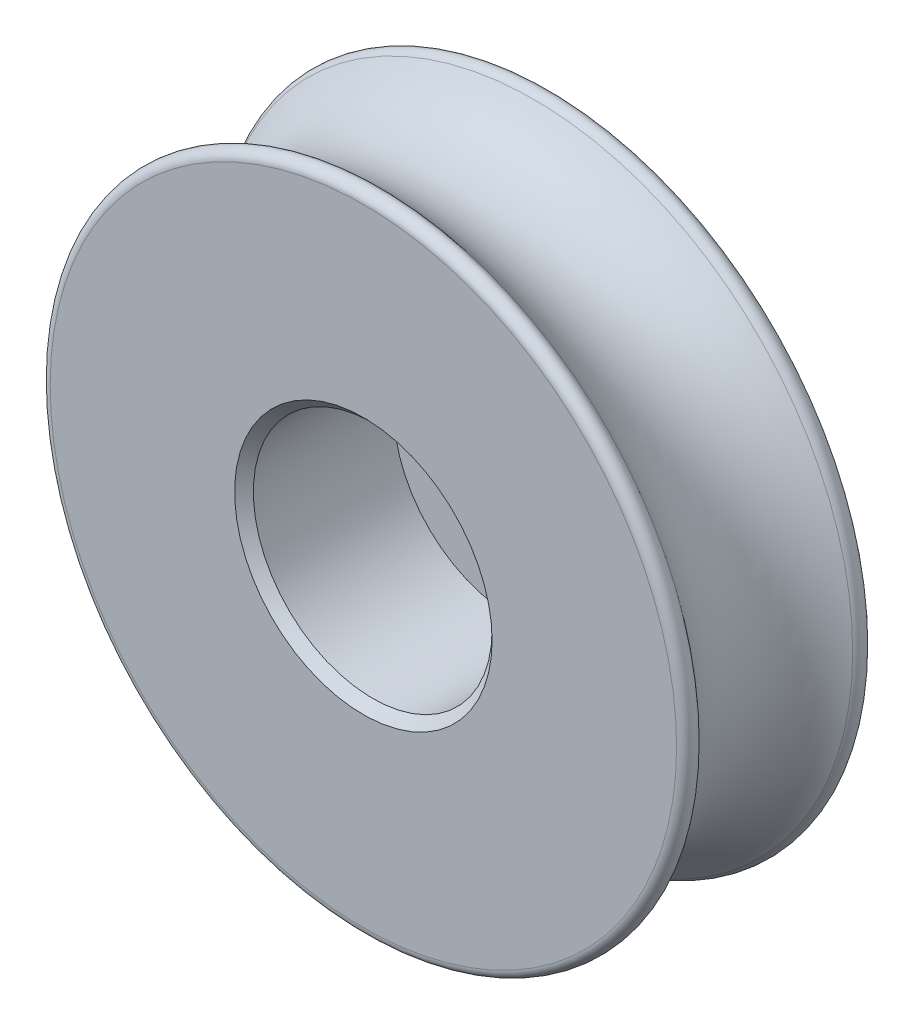
ISO-10303-21;
HEADER;
FILE_DESCRIPTION(('STEP AP214'),'2;1');
FILE_NAME('part.step','',(''),(''),'','','');
FILE_SCHEMA(('AUTOMOTIVE_DESIGN { 1 0 10303 214 1 1 1 1 }'));
ENDSEC;
DATA;
#1=APPLICATION_CONTEXT('core data for automotive mechanical design processes');
#2=APPLICATION_PROTOCOL_DEFINITION('international standard','automotive_design',2000,#1);
#3=PRODUCT_CONTEXT('',#1,'mechanical');
#4=PRODUCT('Part','Part','',(#3));
#5=PRODUCT_RELATED_PRODUCT_CATEGORY('part','',(#4));
#6=PRODUCT_DEFINITION_FORMATION('','',#4);
#7=PRODUCT_DEFINITION_CONTEXT('part definition',#1,'design');
#8=PRODUCT_DEFINITION('design','',#6,#7);
#9=PRODUCT_DEFINITION_SHAPE('','',#8);
#10=(LENGTH_UNIT() NAMED_UNIT(*) SI_UNIT(.MILLI.,.METRE.));
#11=(NAMED_UNIT(*) PLANE_ANGLE_UNIT() SI_UNIT($,.RADIAN.));
#12=(NAMED_UNIT(*) SI_UNIT($,.STERADIAN.) SOLID_ANGLE_UNIT());
#13=UNCERTAINTY_MEASURE_WITH_UNIT(LENGTH_MEASURE(1.E-05),#10,'distance_accuracy_value','');
#14=(GEOMETRIC_REPRESENTATION_CONTEXT(3) GLOBAL_UNCERTAINTY_ASSIGNED_CONTEXT((#13)) GLOBAL_UNIT_ASSIGNED_CONTEXT((#10,
#11,#12)) REPRESENTATION_CONTEXT('',''));
#15=CARTESIAN_POINT('',(0.,0.,0.));
#16=DIRECTION('',(0.,0.,1.));
#17=DIRECTION('',(1.,0.,0.));
#18=AXIS2_PLACEMENT_3D('',#15,#16,#17);
#19=CARTESIAN_POINT('',(0.,0.,-2.));
#20=DIRECTION('',(0.,0.,1.));
#21=DIRECTION('',(1.,0.,0.));
#22=AXIS2_PLACEMENT_3D('',#19,#20,#21);
#23=TOROIDAL_SURFACE('',#22,8.06532258064516,2.06532258064516);
#24=CARTESIAN_POINT('',(0.,0.,-3.64108223567106));
#25=DIRECTION('',(0.,0.,1.));
#26=DIRECTION('',(1.,0.,0.));
#27=AXIS2_PLACEMENT_3D('',#24,#25,#26);
#28=CIRCLE('',#27,6.81136625848411);
#29=CARTESIAN_POINT('',(6.81136625848411,0.,-3.64108223567106));
#30=VERTEX_POINT('',#29);
#31=EDGE_CURVE('E62',#30,#30,#28,.T.);
#32=ORIENTED_EDGE('',*,*,#31,.T.);
#33=EDGE_LOOP('',(#32));
#34=FACE_BOUND('',#33,.T.);
#35=CARTESIAN_POINT('',(0.,0.,-0.358917764328941));
#36=DIRECTION('',(0.,0.,-1.));
#37=DIRECTION('',(-1.,0.,0.));
#38=AXIS2_PLACEMENT_3D('',#35,#36,#37);
#39=CIRCLE('',#38,6.81136625848411);
#40=CARTESIAN_POINT('',(-6.81136625848411,0.,-0.358917764328941));
#41=VERTEX_POINT('',#40);
#42=EDGE_CURVE('E65',#41,#41,#39,.T.);
#43=ORIENTED_EDGE('',*,*,#42,.T.);
#44=EDGE_LOOP('',(#43));
#45=FACE_BOUND('',#44,.T.);
#46=ADVANCED_FACE('F35',(#34,#45),#23,.F.);
#47=CARTESIAN_POINT('',(1.1,0.,-4.));
#48=DIRECTION('',(0.,0.,-1.));
#49=DIRECTION('',(-1.,0.,0.));
#50=AXIS2_PLACEMENT_3D('',#47,#48,#49);
#51=PLANE('',#50);
#52=CARTESIAN_POINT('',(0.,0.,-4.));
#53=DIRECTION('',(0.,0.,-1.));
#54=DIRECTION('',(-1.,0.,0.));
#55=AXIS2_PLACEMENT_3D('',#52,#53,#54);
#56=CIRCLE('',#55,1.3);
#57=CARTESIAN_POINT('',(-1.3,0.,-4.));
#58=VERTEX_POINT('',#57);
#59=EDGE_CURVE('E51',#58,#58,#56,.F.);
#60=ORIENTED_EDGE('',*,*,#59,.T.);
#61=EDGE_LOOP('',(#60));
#62=FACE_BOUND('',#61,.T.);
#63=CARTESIAN_POINT('',(0.,0.,-4.));
#64=DIRECTION('',(0.,0.,-1.));
#65=DIRECTION('',(-1.,0.,0.));
#66=AXIS2_PLACEMENT_3D('',#63,#64,#65);
#67=CIRCLE('',#66,6.68993667320651);
#68=CARTESIAN_POINT('',(-6.68993667320651,0.,-4.));
#69=VERTEX_POINT('',#68);
#70=EDGE_CURVE('E59',#69,#69,#67,.T.);
#71=ORIENTED_EDGE('',*,*,#70,.T.);
#72=EDGE_LOOP('',(#71));
#73=FACE_BOUND('',#72,.T.);
#74=ADVANCED_FACE('F91',(#62,#73),#51,.T.);
#75=CARTESIAN_POINT('',(0.,0.,0.));
#76=DIRECTION('',(0.,0.,1.));
#77=DIRECTION('',(1.,0.,0.));
#78=AXIS2_PLACEMENT_3D('',#75,#76,#77);
#79=CYLINDRICAL_SURFACE('',#78,1.1);
#80=CARTESIAN_POINT('',(0.,0.,-3.8));
#81=DIRECTION('',(0.,0.,-1.));
#82=DIRECTION('',(-1.,0.,0.));
#83=AXIS2_PLACEMENT_3D('',#80,#81,#82);
#84=CIRCLE('',#83,1.1);
#85=CARTESIAN_POINT('',(-1.1,0.,-3.8));
#86=VERTEX_POINT('',#85);
#87=EDGE_CURVE('E47',#86,#86,#84,.T.);
#88=ORIENTED_EDGE('',*,*,#87,.T.);
#89=EDGE_LOOP('',(#88));
#90=FACE_BOUND('',#89,.T.);
#91=CARTESIAN_POINT('',(0.,0.,-3.2));
#92=DIRECTION('',(0.,0.,1.));
#93=DIRECTION('',(1.,0.,0.));
#94=AXIS2_PLACEMENT_3D('',#91,#92,#93);
#95=CIRCLE('',#94,1.1);
#96=CARTESIAN_POINT('',(1.1,0.,-3.2));
#97=VERTEX_POINT('',#96);
#98=EDGE_CURVE('E68',#97,#97,#95,.T.);
#99=ORIENTED_EDGE('',*,*,#98,.T.);
#100=EDGE_LOOP('',(#99));
#101=FACE_BOUND('',#100,.T.);
#102=ADVANCED_FACE('F88',(#90,#101),#79,.F.);
#103=CARTESIAN_POINT('',(2.55,0.,-3.2));
#104=DIRECTION('',(0.,0.,1.));
#105=DIRECTION('',(1.,0.,0.));
#106=AXIS2_PLACEMENT_3D('',#103,#104,#105);
#107=PLANE('',#106);
#108=CARTESIAN_POINT('',(0.,0.,-3.2));
#109=DIRECTION('',(0.,0.,1.));
#110=DIRECTION('',(1.,0.,0.));
#111=AXIS2_PLACEMENT_3D('',#108,#109,#110);
#112=CIRCLE('',#111,2.55);
#113=CARTESIAN_POINT('',(2.55,0.,-3.2));
#114=VERTEX_POINT('',#113);
#115=EDGE_CURVE('E71',#114,#114,#112,.T.);
#116=ORIENTED_EDGE('',*,*,#115,.T.);
#117=EDGE_LOOP('',(#116));
#118=FACE_BOUND('',#117,.T.);
#119=ORIENTED_EDGE('',*,*,#98,.F.);
#120=EDGE_LOOP('',(#119));
#121=FACE_BOUND('',#120,.T.);
#122=ADVANCED_FACE('F75',(#118,#121),#107,.T.);
#123=CARTESIAN_POINT('',(0.,0.,0.));
#124=DIRECTION('',(0.,0.,1.));
#125=DIRECTION('',(1.,0.,0.));
#126=AXIS2_PLACEMENT_3D('',#123,#124,#125);
#127=CYLINDRICAL_SURFACE('',#126,2.55);
#128=CARTESIAN_POINT('',(0.,0.,-0.200000000000003));
#129=DIRECTION('',(0.,0.,1.));
#130=DIRECTION('',(1.,0.,0.));
#131=AXIS2_PLACEMENT_3D('',#128,#129,#130);
#132=CIRCLE('',#131,2.55);
#133=CARTESIAN_POINT('',(2.55,0.,-0.200000000000003));
#134=VERTEX_POINT('',#133);
#135=EDGE_CURVE('E43',#134,#134,#132,.T.);
#136=ORIENTED_EDGE('',*,*,#135,.T.);
#137=EDGE_LOOP('',(#136));
#138=FACE_BOUND('',#137,.T.);
#139=ORIENTED_EDGE('',*,*,#115,.F.);
#140=EDGE_LOOP('',(#139));
#141=FACE_BOUND('',#140,.T.);
#142=ADVANCED_FACE('F78',(#138,#141),#127,.F.);
#143=CARTESIAN_POINT('',(7.55,0.,0.));
#144=DIRECTION('',(0.,0.,1.));
#145=DIRECTION('',(1.,0.,0.));
#146=AXIS2_PLACEMENT_3D('',#143,#144,#145);
#147=PLANE('',#146);
#148=CARTESIAN_POINT('',(0.,0.,0.));
#149=DIRECTION('',(0.,0.,1.));
#150=DIRECTION('',(1.,0.,0.));
#151=AXIS2_PLACEMENT_3D('',#148,#149,#150);
#152=CIRCLE('',#151,2.75);
#153=CARTESIAN_POINT('',(2.75,0.,0.));
#154=VERTEX_POINT('',#153);
#155=EDGE_CURVE('E10',#154,#154,#152,.F.);
#156=ORIENTED_EDGE('',*,*,#155,.T.);
#157=EDGE_LOOP('',(#156));
#158=FACE_BOUND('',#157,.T.);
#159=CARTESIAN_POINT('',(0.,0.,0.));
#160=DIRECTION('',(0.,0.,1.));
#161=DIRECTION('',(1.,0.,0.));
#162=AXIS2_PLACEMENT_3D('',#159,#160,#161);
#163=CIRCLE('',#162,6.68993667320651);
#164=CARTESIAN_POINT('',(6.68993667320651,0.,0.));
#165=VERTEX_POINT('',#164);
#166=EDGE_CURVE('E56',#165,#165,#163,.T.);
#167=ORIENTED_EDGE('',*,*,#166,.T.);
#168=EDGE_LOOP('',(#167));
#169=FACE_BOUND('',#168,.T.);
#170=ADVANCED_FACE('F80',(#158,#169),#147,.T.);
#171=CARTESIAN_POINT('',(0.,0.,-3.8));
#172=DIRECTION('',(0.,0.,1.));
#173=DIRECTION('',(1.,0.,0.));
#174=AXIS2_PLACEMENT_3D('',#171,#172,#173);
#175=TOROIDAL_SURFACE('',#174,6.68993667320651,0.2);
#176=ORIENTED_EDGE('',*,*,#70,.F.);
#177=EDGE_LOOP('',(#176));
#178=FACE_BOUND('',#177,.T.);
#179=ORIENTED_EDGE('',*,*,#31,.F.);
#180=EDGE_LOOP('',(#179));
#181=FACE_BOUND('',#180,.T.);
#182=ADVANCED_FACE('F86',(#178,#181),#175,.T.);
#183=CARTESIAN_POINT('',(0.,0.,-0.2));
#184=DIRECTION('',(0.,0.,-1.));
#185=DIRECTION('',(-1.,0.,0.));
#186=AXIS2_PLACEMENT_3D('',#183,#184,#185);
#187=TOROIDAL_SURFACE('',#186,6.68993667320651,0.2);
#188=ORIENTED_EDGE('',*,*,#42,.F.);
#189=EDGE_LOOP('',(#188));
#190=FACE_BOUND('',#189,.T.);
#191=ORIENTED_EDGE('',*,*,#166,.F.);
#192=EDGE_LOOP('',(#191));
#193=FACE_BOUND('',#192,.T.);
#194=ADVANCED_FACE('F104',(#190,#193),#187,.T.);
#195=CARTESIAN_POINT('',(0.,0.,-4.));
#196=DIRECTION('',(0.,0.,-1.));
#197=DIRECTION('',(-1.,0.,0.));
#198=AXIS2_PLACEMENT_3D('',#195,#196,#197);
#199=CONICAL_SURFACE('',#198,1.3,0.785398163397449);
#200=ORIENTED_EDGE('',*,*,#87,.F.);
#201=EDGE_LOOP('',(#200));
#202=FACE_BOUND('',#201,.T.);
#203=ORIENTED_EDGE('',*,*,#59,.F.);
#204=EDGE_LOOP('',(#203));
#205=FACE_BOUND('',#204,.T.);
#206=ADVANCED_FACE('F107',(#202,#205),#199,.F.);
#207=CARTESIAN_POINT('',(0.,0.,-0.200000000000003));
#208=DIRECTION('',(0.,0.,1.));
#209=DIRECTION('',(1.,0.,0.));
#210=AXIS2_PLACEMENT_3D('',#207,#208,#209);
#211=CONICAL_SURFACE('',#210,2.55,0.785398163397443);
#212=ORIENTED_EDGE('',*,*,#155,.F.);
#213=EDGE_LOOP('',(#212));
#214=FACE_BOUND('',#213,.T.);
#215=ORIENTED_EDGE('',*,*,#135,.F.);
#216=EDGE_LOOP('',(#215));
#217=FACE_BOUND('',#216,.T.);
#218=ADVANCED_FACE('F38',(#214,#217),#211,.F.);
#219=CLOSED_SHELL('',(#46,#74,#102,#122,#142,#170,#182,#194,#206,#218));
#220=MANIFOLD_SOLID_BREP('B2',#219);
#221=ADVANCED_BREP_SHAPE_REPRESENTATION('',(#18,#220),#14);
#222=SHAPE_DEFINITION_REPRESENTATION(#9,#221);
ENDSEC;
END-ISO-10303-21;
